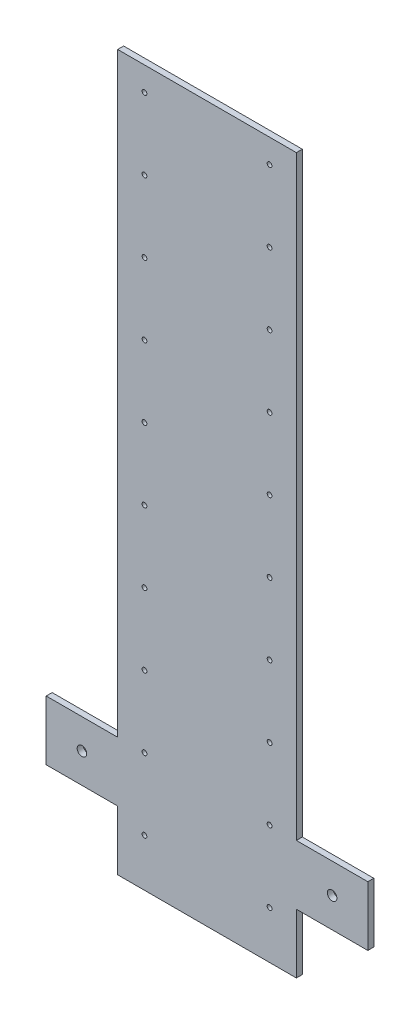
ISO-10303-21;
HEADER;
FILE_DESCRIPTION(('STEP AP214'),'2;1');
FILE_NAME('part.step','',(''),(''),'','','');
FILE_SCHEMA(('AUTOMOTIVE_DESIGN { 1 0 10303 214 1 1 1 1 }'));
ENDSEC;
DATA;
#1=APPLICATION_CONTEXT('core data for automotive mechanical design processes');
#2=APPLICATION_PROTOCOL_DEFINITION('international standard','automotive_design',2000,#1);
#3=PRODUCT_CONTEXT('',#1,'mechanical');
#4=PRODUCT('Part','Part','',(#3));
#5=PRODUCT_RELATED_PRODUCT_CATEGORY('part','',(#4));
#6=PRODUCT_DEFINITION_FORMATION('','',#4);
#7=PRODUCT_DEFINITION_CONTEXT('part definition',#1,'design');
#8=PRODUCT_DEFINITION('design','',#6,#7);
#9=PRODUCT_DEFINITION_SHAPE('','',#8);
#10=(LENGTH_UNIT() NAMED_UNIT(*) SI_UNIT(.MILLI.,.METRE.));
#11=(NAMED_UNIT(*) PLANE_ANGLE_UNIT() SI_UNIT($,.RADIAN.));
#12=(NAMED_UNIT(*) SI_UNIT($,.STERADIAN.) SOLID_ANGLE_UNIT());
#13=UNCERTAINTY_MEASURE_WITH_UNIT(LENGTH_MEASURE(1.E-05),#10,'distance_accuracy_value','');
#14=(GEOMETRIC_REPRESENTATION_CONTEXT(3) GLOBAL_UNCERTAINTY_ASSIGNED_CONTEXT((#13)) GLOBAL_UNIT_ASSIGNED_CONTEXT((#10,
#11,#12)) REPRESENTATION_CONTEXT('',''));
#15=CARTESIAN_POINT('',(0.,0.,0.));
#16=DIRECTION('',(0.,0.,1.));
#17=DIRECTION('',(1.,0.,0.));
#18=AXIS2_PLACEMENT_3D('',#15,#16,#17);
#19=CARTESIAN_POINT('',(0.,0.,5.));
#20=DIRECTION('',(0.,0.,1.));
#21=DIRECTION('',(1.,0.,0.));
#22=AXIS2_PLACEMENT_3D('',#19,#20,#21);
#23=PLANE('',#22);
#24=CARTESIAN_POINT('',(52.5,100.,5.));
#25=DIRECTION('',(0.,0.,1.));
#26=DIRECTION('',(-1.,0.,0.));
#27=AXIS2_PLACEMENT_3D('',#24,#25,#26);
#28=CIRCLE('',#27,2.);
#29=CARTESIAN_POINT('',(50.5,100.,5.));
#30=VERTEX_POINT('',#29);
#31=EDGE_CURVE('E405',#30,#30,#28,.T.);
#32=ORIENTED_EDGE('',*,*,#31,.F.);
#33=EDGE_LOOP('',(#32));
#34=FACE_BOUND('',#33,.T.);
#35=CARTESIAN_POINT('',(52.5,40.,5.));
#36=DIRECTION('',(0.,0.,1.));
#37=DIRECTION('',(-1.,0.,0.));
#38=AXIS2_PLACEMENT_3D('',#35,#36,#37);
#39=CIRCLE('',#38,2.);
#40=CARTESIAN_POINT('',(50.5,40.,5.));
#41=VERTEX_POINT('',#40);
#42=EDGE_CURVE('E475',#41,#41,#39,.T.);
#43=ORIENTED_EDGE('',*,*,#42,.F.);
#44=EDGE_LOOP('',(#43));
#45=FACE_BOUND('',#44,.T.);
#46=CARTESIAN_POINT('',(52.5,-20.,5.));
#47=DIRECTION('',(0.,0.,1.));
#48=DIRECTION('',(-1.,0.,0.));
#49=AXIS2_PLACEMENT_3D('',#46,#47,#48);
#50=CIRCLE('',#49,2.);
#51=CARTESIAN_POINT('',(50.5,-20.,5.));
#52=VERTEX_POINT('',#51);
#53=EDGE_CURVE('E467',#52,#52,#50,.T.);
#54=ORIENTED_EDGE('',*,*,#53,.F.);
#55=EDGE_LOOP('',(#54));
#56=FACE_BOUND('',#55,.T.);
#57=CARTESIAN_POINT('',(52.5,-80.,5.));
#58=DIRECTION('',(0.,0.,1.));
#59=DIRECTION('',(-1.,0.,0.));
#60=AXIS2_PLACEMENT_3D('',#57,#58,#59);
#61=CIRCLE('',#60,2.);
#62=CARTESIAN_POINT('',(50.5,-80.,5.));
#63=VERTEX_POINT('',#62);
#64=EDGE_CURVE('E459',#63,#63,#61,.T.);
#65=ORIENTED_EDGE('',*,*,#64,.F.);
#66=EDGE_LOOP('',(#65));
#67=FACE_BOUND('',#66,.T.);
#68=CARTESIAN_POINT('',(52.5,-140.,5.));
#69=DIRECTION('',(0.,0.,1.));
#70=DIRECTION('',(-1.,0.,0.));
#71=AXIS2_PLACEMENT_3D('',#68,#69,#70);
#72=CIRCLE('',#71,2.);
#73=CARTESIAN_POINT('',(50.5,-140.,5.));
#74=VERTEX_POINT('',#73);
#75=EDGE_CURVE('E451',#74,#74,#72,.T.);
#76=ORIENTED_EDGE('',*,*,#75,.F.);
#77=EDGE_LOOP('',(#76));
#78=FACE_BOUND('',#77,.T.);
#79=CARTESIAN_POINT('',(52.5,-200.,5.));
#80=DIRECTION('',(0.,0.,1.));
#81=DIRECTION('',(-1.,0.,0.));
#82=AXIS2_PLACEMENT_3D('',#79,#80,#81);
#83=CIRCLE('',#82,2.);
#84=CARTESIAN_POINT('',(50.5,-200.,5.));
#85=VERTEX_POINT('',#84);
#86=EDGE_CURVE('E443',#85,#85,#83,.T.);
#87=ORIENTED_EDGE('',*,*,#86,.F.);
#88=EDGE_LOOP('',(#87));
#89=FACE_BOUND('',#88,.T.);
#90=CARTESIAN_POINT('',(-52.5,-260.,5.));
#91=DIRECTION('',(0.,0.,1.));
#92=DIRECTION('',(1.,0.,0.));
#93=AXIS2_PLACEMENT_3D('',#90,#91,#92);
#94=CIRCLE('',#93,2.);
#95=CARTESIAN_POINT('',(-50.5,-260.,5.));
#96=VERTEX_POINT('',#95);
#97=EDGE_CURVE('E435',#96,#96,#94,.T.);
#98=ORIENTED_EDGE('',*,*,#97,.F.);
#99=EDGE_LOOP('',(#98));
#100=FACE_BOUND('',#99,.T.);
#101=CARTESIAN_POINT('',(-52.5,-200.,5.));
#102=DIRECTION('',(0.,0.,1.));
#103=DIRECTION('',(1.,0.,0.));
#104=AXIS2_PLACEMENT_3D('',#101,#102,#103);
#105=CIRCLE('',#104,2.);
#106=CARTESIAN_POINT('',(-50.5,-200.,5.));
#107=VERTEX_POINT('',#106);
#108=EDGE_CURVE('E427',#107,#107,#105,.T.);
#109=ORIENTED_EDGE('',*,*,#108,.F.);
#110=EDGE_LOOP('',(#109));
#111=FACE_BOUND('',#110,.T.);
#112=CARTESIAN_POINT('',(-52.5,-140.,5.));
#113=DIRECTION('',(0.,0.,1.));
#114=DIRECTION('',(1.,0.,0.));
#115=AXIS2_PLACEMENT_3D('',#112,#113,#114);
#116=CIRCLE('',#115,2.);
#117=CARTESIAN_POINT('',(-50.5,-140.,5.));
#118=VERTEX_POINT('',#117);
#119=EDGE_CURVE('E426',#118,#118,#116,.T.);
#120=ORIENTED_EDGE('',*,*,#119,.F.);
#121=EDGE_LOOP('',(#120));
#122=FACE_BOUND('',#121,.T.);
#123=CARTESIAN_POINT('',(-52.5,-80.,5.));
#124=DIRECTION('',(0.,0.,1.));
#125=DIRECTION('',(1.,0.,0.));
#126=AXIS2_PLACEMENT_3D('',#123,#124,#125);
#127=CIRCLE('',#126,2.);
#128=CARTESIAN_POINT('',(-50.5,-80.,5.));
#129=VERTEX_POINT('',#128);
#130=EDGE_CURVE('E539',#129,#129,#127,.T.);
#131=ORIENTED_EDGE('',*,*,#130,.F.);
#132=EDGE_LOOP('',(#131));
#133=FACE_BOUND('',#132,.T.);
#134=CARTESIAN_POINT('',(-52.5,-20.,5.));
#135=DIRECTION('',(0.,0.,1.));
#136=DIRECTION('',(1.,0.,0.));
#137=AXIS2_PLACEMENT_3D('',#134,#135,#136);
#138=CIRCLE('',#137,2.);
#139=CARTESIAN_POINT('',(-50.5,-20.,5.));
#140=VERTEX_POINT('',#139);
#141=EDGE_CURVE('E531',#140,#140,#138,.T.);
#142=ORIENTED_EDGE('',*,*,#141,.F.);
#143=EDGE_LOOP('',(#142));
#144=FACE_BOUND('',#143,.T.);
#145=CARTESIAN_POINT('',(-52.5,40.,5.));
#146=DIRECTION('',(0.,0.,1.));
#147=DIRECTION('',(1.,0.,0.));
#148=AXIS2_PLACEMENT_3D('',#145,#146,#147);
#149=CIRCLE('',#148,2.);
#150=CARTESIAN_POINT('',(-50.5,40.,5.));
#151=VERTEX_POINT('',#150);
#152=EDGE_CURVE('E523',#151,#151,#149,.T.);
#153=ORIENTED_EDGE('',*,*,#152,.F.);
#154=EDGE_LOOP('',(#153));
#155=FACE_BOUND('',#154,.T.);
#156=CARTESIAN_POINT('',(-52.5,100.,5.));
#157=DIRECTION('',(0.,0.,1.));
#158=DIRECTION('',(1.,0.,0.));
#159=AXIS2_PLACEMENT_3D('',#156,#157,#158);
#160=CIRCLE('',#159,2.);
#161=CARTESIAN_POINT('',(-50.5,100.,5.));
#162=VERTEX_POINT('',#161);
#163=EDGE_CURVE('E515',#162,#162,#160,.T.);
#164=ORIENTED_EDGE('',*,*,#163,.F.);
#165=EDGE_LOOP('',(#164));
#166=FACE_BOUND('',#165,.T.);
#167=CARTESIAN_POINT('',(-52.5,160.,5.));
#168=DIRECTION('',(0.,0.,1.));
#169=DIRECTION('',(1.,0.,0.));
#170=AXIS2_PLACEMENT_3D('',#167,#168,#169);
#171=CIRCLE('',#170,2.00000000000001);
#172=CARTESIAN_POINT('',(-50.5,160.,5.));
#173=VERTEX_POINT('',#172);
#174=EDGE_CURVE('E507',#173,#173,#171,.T.);
#175=ORIENTED_EDGE('',*,*,#174,.F.);
#176=EDGE_LOOP('',(#175));
#177=FACE_BOUND('',#176,.T.);
#178=CARTESIAN_POINT('',(-52.5,220.,5.));
#179=DIRECTION('',(0.,0.,1.));
#180=DIRECTION('',(1.,0.,0.));
#181=AXIS2_PLACEMENT_3D('',#178,#179,#180);
#182=CIRCLE('',#181,2.);
#183=CARTESIAN_POINT('',(-50.5,220.,5.));
#184=VERTEX_POINT('',#183);
#185=EDGE_CURVE('E499',#184,#184,#182,.T.);
#186=ORIENTED_EDGE('',*,*,#185,.F.);
#187=EDGE_LOOP('',(#186));
#188=FACE_BOUND('',#187,.T.);
#189=CARTESIAN_POINT('',(-52.5,280.,5.));
#190=DIRECTION('',(0.,0.,1.));
#191=DIRECTION('',(1.,0.,0.));
#192=AXIS2_PLACEMENT_3D('',#189,#190,#191);
#193=CIRCLE('',#192,2.00000000000002);
#194=CARTESIAN_POINT('',(-50.5,280.,5.));
#195=VERTEX_POINT('',#194);
#196=EDGE_CURVE('E491',#195,#195,#193,.T.);
#197=ORIENTED_EDGE('',*,*,#196,.F.);
#198=EDGE_LOOP('',(#197));
#199=FACE_BOUND('',#198,.T.);
#200=CARTESIAN_POINT('',(52.5,160.,5.));
#201=DIRECTION('',(0.,0.,1.));
#202=DIRECTION('',(-1.,0.,0.));
#203=AXIS2_PLACEMENT_3D('',#200,#201,#202);
#204=CIRCLE('',#203,2.00000000000001);
#205=CARTESIAN_POINT('',(50.5,160.,5.));
#206=VERTEX_POINT('',#205);
#207=EDGE_CURVE('E398',#206,#206,#204,.T.);
#208=ORIENTED_EDGE('',*,*,#207,.F.);
#209=EDGE_LOOP('',(#208));
#210=FACE_BOUND('',#209,.T.);
#211=CARTESIAN_POINT('',(52.5,220.,5.));
#212=DIRECTION('',(0.,0.,1.));
#213=DIRECTION('',(-1.,0.,0.));
#214=AXIS2_PLACEMENT_3D('',#211,#212,#213);
#215=CIRCLE('',#214,2.);
#216=CARTESIAN_POINT('',(50.5,220.,5.));
#217=VERTEX_POINT('',#216);
#218=EDGE_CURVE('E408',#217,#217,#215,.T.);
#219=ORIENTED_EDGE('',*,*,#218,.F.);
#220=EDGE_LOOP('',(#219));
#221=FACE_BOUND('',#220,.T.);
#222=CARTESIAN_POINT('',(52.5,280.,5.));
#223=DIRECTION('',(0.,0.,1.));
#224=DIRECTION('',(-1.,0.,0.));
#225=AXIS2_PLACEMENT_3D('',#222,#223,#224);
#226=CIRCLE('',#225,2.00000000000002);
#227=CARTESIAN_POINT('',(50.5,280.,5.));
#228=VERTEX_POINT('',#227);
#229=EDGE_CURVE('E418',#228,#228,#226,.T.);
#230=ORIENTED_EDGE('',*,*,#229,.F.);
#231=EDGE_LOOP('',(#230));
#232=FACE_BOUND('',#231,.T.);
#233=CARTESIAN_POINT('',(52.5,-260.,5.));
#234=DIRECTION('',(0.,0.,1.));
#235=DIRECTION('',(-1.,0.,0.));
#236=AXIS2_PLACEMENT_3D('',#233,#234,#235);
#237=CIRCLE('',#236,2.);
#238=CARTESIAN_POINT('',(50.5,-260.,5.));
#239=VERTEX_POINT('',#238);
#240=EDGE_CURVE('E490',#239,#239,#237,.T.);
#241=ORIENTED_EDGE('',*,*,#240,.F.);
#242=EDGE_LOOP('',(#241));
#243=FACE_BOUND('',#242,.T.);
#244=CARTESIAN_POINT('',(-105.,-225.,5.));
#245=DIRECTION('',(0.,0.,1.));
#246=DIRECTION('',(1.,0.,0.));
#247=AXIS2_PLACEMENT_3D('',#244,#245,#246);
#248=CIRCLE('',#247,3.99999999999999);
#249=CARTESIAN_POINT('',(-101.,-225.,5.));
#250=VERTEX_POINT('',#249);
#251=EDGE_CURVE('E170',#250,#250,#248,.T.);
#252=ORIENTED_EDGE('',*,*,#251,.F.);
#253=EDGE_LOOP('',(#252));
#254=FACE_BOUND('',#253,.T.);
#255=DIRECTION('',(1.,0.,0.));
#256=VECTOR('',#255,1.);
#257=CARTESIAN_POINT('',(135.,-250.,5.));
#258=LINE('',#257,#256);
#259=CARTESIAN_POINT('',(75.,-250.,5.));
#260=VERTEX_POINT('',#259);
#261=CARTESIAN_POINT('',(135.,-250.,5.));
#262=VERTEX_POINT('',#261);
#263=EDGE_CURVE('E200',#260,#262,#258,.T.);
#264=ORIENTED_EDGE('',*,*,#263,.T.);
#265=DIRECTION('',(0.,1.,0.));
#266=VECTOR('',#265,1.);
#267=CARTESIAN_POINT('',(135.,-200.,5.));
#268=LINE('',#267,#266);
#269=CARTESIAN_POINT('',(135.,-200.,5.));
#270=VERTEX_POINT('',#269);
#271=EDGE_CURVE('E112',#262,#270,#268,.T.);
#272=ORIENTED_EDGE('',*,*,#271,.T.);
#273=DIRECTION('',(-1.,0.,0.));
#274=VECTOR('',#273,1.);
#275=CARTESIAN_POINT('',(75.,-200.,5.));
#276=LINE('',#275,#274);
#277=CARTESIAN_POINT('',(75.,-200.,5.));
#278=VERTEX_POINT('',#277);
#279=EDGE_CURVE('E237',#270,#278,#276,.T.);
#280=ORIENTED_EDGE('',*,*,#279,.T.);
#281=DIRECTION('',(0.,1.,0.));
#282=VECTOR('',#281,1.);
#283=CARTESIAN_POINT('',(75.,300.,5.));
#284=LINE('',#283,#282);
#285=CARTESIAN_POINT('',(75.,300.,5.));
#286=VERTEX_POINT('',#285);
#287=EDGE_CURVE('E257',#278,#286,#284,.T.);
#288=ORIENTED_EDGE('',*,*,#287,.T.);
#289=DIRECTION('',(-1.,0.,0.));
#290=VECTOR('',#289,1.);
#291=CARTESIAN_POINT('',(75.,300.,5.));
#292=LINE('',#291,#290);
#293=CARTESIAN_POINT('',(-75.,300.,5.));
#294=VERTEX_POINT('',#293);
#295=EDGE_CURVE('E253',#286,#294,#292,.T.);
#296=ORIENTED_EDGE('',*,*,#295,.T.);
#297=DIRECTION('',(0.,-1.,0.));
#298=VECTOR('',#297,1.);
#299=CARTESIAN_POINT('',(-75.,300.,5.));
#300=LINE('',#299,#298);
#301=CARTESIAN_POINT('',(-75.,-200.,5.));
#302=VERTEX_POINT('',#301);
#303=EDGE_CURVE('E256',#294,#302,#300,.T.);
#304=ORIENTED_EDGE('',*,*,#303,.T.);
#305=DIRECTION('',(-1.,0.,0.));
#306=VECTOR('',#305,1.);
#307=CARTESIAN_POINT('',(-75.,-200.,5.));
#308=LINE('',#307,#306);
#309=CARTESIAN_POINT('',(-135.,-200.,5.));
#310=VERTEX_POINT('',#309);
#311=EDGE_CURVE('E261',#302,#310,#308,.T.);
#312=ORIENTED_EDGE('',*,*,#311,.T.);
#313=DIRECTION('',(0.,-1.,0.));
#314=VECTOR('',#313,1.);
#315=CARTESIAN_POINT('',(-135.,-200.,5.));
#316=LINE('',#315,#314);
#317=CARTESIAN_POINT('',(-135.,-250.,5.));
#318=VERTEX_POINT('',#317);
#319=EDGE_CURVE('E268',#310,#318,#316,.T.);
#320=ORIENTED_EDGE('',*,*,#319,.T.);
#321=DIRECTION('',(1.,0.,0.));
#322=VECTOR('',#321,1.);
#323=CARTESIAN_POINT('',(-135.,-250.,5.));
#324=LINE('',#323,#322);
#325=CARTESIAN_POINT('',(-75.,-250.,5.));
#326=VERTEX_POINT('',#325);
#327=EDGE_CURVE('E143',#318,#326,#324,.T.);
#328=ORIENTED_EDGE('',*,*,#327,.T.);
#329=DIRECTION('',(0.,-1.,0.));
#330=VECTOR('',#329,1.);
#331=CARTESIAN_POINT('',(-75.,-250.,5.));
#332=LINE('',#331,#330);
#333=CARTESIAN_POINT('',(-75.,-300.,5.));
#334=VERTEX_POINT('',#333);
#335=EDGE_CURVE('E137',#326,#334,#332,.T.);
#336=ORIENTED_EDGE('',*,*,#335,.T.);
#337=DIRECTION('',(1.,0.,0.));
#338=VECTOR('',#337,1.);
#339=CARTESIAN_POINT('',(-75.,-300.,5.));
#340=LINE('',#339,#338);
#341=CARTESIAN_POINT('',(75.,-300.,5.));
#342=VERTEX_POINT('',#341);
#343=EDGE_CURVE('E141',#334,#342,#340,.T.);
#344=ORIENTED_EDGE('',*,*,#343,.T.);
#345=DIRECTION('',(0.,1.,0.));
#346=VECTOR('',#345,1.);
#347=CARTESIAN_POINT('',(75.,-250.,5.));
#348=LINE('',#347,#346);
#349=EDGE_CURVE('E57',#342,#260,#348,.T.);
#350=ORIENTED_EDGE('',*,*,#349,.T.);
#351=EDGE_LOOP('',(#264,#272,#280,#288,#296,#304,#312,#320,#328,#336,#344,#350));
#352=FACE_BOUND('',#351,.T.);
#353=CARTESIAN_POINT('',(105.,-225.,5.));
#354=DIRECTION('',(0.,0.,1.));
#355=DIRECTION('',(1.,0.,0.));
#356=AXIS2_PLACEMENT_3D('',#353,#354,#355);
#357=CIRCLE('',#356,3.99999999999999);
#358=CARTESIAN_POINT('',(109.,-225.,5.));
#359=VERTEX_POINT('',#358);
#360=EDGE_CURVE('E558',#359,#359,#357,.T.);
#361=ORIENTED_EDGE('',*,*,#360,.F.);
#362=EDGE_LOOP('',(#361));
#363=FACE_BOUND('',#362,.T.);
#364=ADVANCED_FACE('F39',(#34,#45,#56,#67,#78,#89,#100,#111,#122,#133,#144,#155,#166,#177,#188,
#199,#210,#221,#232,#243,#254,#352,#363),#23,.T.);
#365=CARTESIAN_POINT('',(0.,0.,0.));
#366=DIRECTION('',(0.,0.,1.));
#367=DIRECTION('',(1.,0.,0.));
#368=AXIS2_PLACEMENT_3D('',#365,#366,#367);
#369=PLANE('',#368);
#370=CARTESIAN_POINT('',(52.5,100.,0.));
#371=DIRECTION('',(0.,0.,1.));
#372=DIRECTION('',(-1.,0.,0.));
#373=AXIS2_PLACEMENT_3D('',#370,#371,#372);
#374=CIRCLE('',#373,2.);
#375=CARTESIAN_POINT('',(50.5,100.,0.));
#376=VERTEX_POINT('',#375);
#377=EDGE_CURVE('E479',#376,#376,#374,.T.);
#378=ORIENTED_EDGE('',*,*,#377,.T.);
#379=EDGE_LOOP('',(#378));
#380=FACE_BOUND('',#379,.T.);
#381=CARTESIAN_POINT('',(52.5,40.,0.));
#382=DIRECTION('',(0.,0.,1.));
#383=DIRECTION('',(-1.,0.,0.));
#384=AXIS2_PLACEMENT_3D('',#381,#382,#383);
#385=CIRCLE('',#384,2.);
#386=CARTESIAN_POINT('',(50.5,40.,0.));
#387=VERTEX_POINT('',#386);
#388=EDGE_CURVE('E471',#387,#387,#385,.T.);
#389=ORIENTED_EDGE('',*,*,#388,.T.);
#390=EDGE_LOOP('',(#389));
#391=FACE_BOUND('',#390,.T.);
#392=CARTESIAN_POINT('',(52.5,-20.,0.));
#393=DIRECTION('',(0.,0.,1.));
#394=DIRECTION('',(-1.,0.,0.));
#395=AXIS2_PLACEMENT_3D('',#392,#393,#394);
#396=CIRCLE('',#395,2.);
#397=CARTESIAN_POINT('',(50.5,-20.,0.));
#398=VERTEX_POINT('',#397);
#399=EDGE_CURVE('E463',#398,#398,#396,.T.);
#400=ORIENTED_EDGE('',*,*,#399,.T.);
#401=EDGE_LOOP('',(#400));
#402=FACE_BOUND('',#401,.T.);
#403=CARTESIAN_POINT('',(52.5,-80.,0.));
#404=DIRECTION('',(0.,0.,1.));
#405=DIRECTION('',(-1.,0.,0.));
#406=AXIS2_PLACEMENT_3D('',#403,#404,#405);
#407=CIRCLE('',#406,2.);
#408=CARTESIAN_POINT('',(50.5,-80.,0.));
#409=VERTEX_POINT('',#408);
#410=EDGE_CURVE('E455',#409,#409,#407,.T.);
#411=ORIENTED_EDGE('',*,*,#410,.T.);
#412=EDGE_LOOP('',(#411));
#413=FACE_BOUND('',#412,.T.);
#414=CARTESIAN_POINT('',(52.5,-140.,0.));
#415=DIRECTION('',(0.,0.,1.));
#416=DIRECTION('',(-1.,0.,0.));
#417=AXIS2_PLACEMENT_3D('',#414,#415,#416);
#418=CIRCLE('',#417,2.);
#419=CARTESIAN_POINT('',(50.5,-140.,0.));
#420=VERTEX_POINT('',#419);
#421=EDGE_CURVE('E447',#420,#420,#418,.T.);
#422=ORIENTED_EDGE('',*,*,#421,.T.);
#423=EDGE_LOOP('',(#422));
#424=FACE_BOUND('',#423,.T.);
#425=CARTESIAN_POINT('',(52.5,-200.,0.));
#426=DIRECTION('',(0.,0.,1.));
#427=DIRECTION('',(-1.,0.,0.));
#428=AXIS2_PLACEMENT_3D('',#425,#426,#427);
#429=CIRCLE('',#428,2.);
#430=CARTESIAN_POINT('',(50.5,-200.,0.));
#431=VERTEX_POINT('',#430);
#432=EDGE_CURVE('E439',#431,#431,#429,.T.);
#433=ORIENTED_EDGE('',*,*,#432,.T.);
#434=EDGE_LOOP('',(#433));
#435=FACE_BOUND('',#434,.T.);
#436=CARTESIAN_POINT('',(-52.5,-260.,0.));
#437=DIRECTION('',(0.,0.,1.));
#438=DIRECTION('',(1.,0.,0.));
#439=AXIS2_PLACEMENT_3D('',#436,#437,#438);
#440=CIRCLE('',#439,2.);
#441=CARTESIAN_POINT('',(-50.5,-260.,0.));
#442=VERTEX_POINT('',#441);
#443=EDGE_CURVE('E431',#442,#442,#440,.T.);
#444=ORIENTED_EDGE('',*,*,#443,.T.);
#445=EDGE_LOOP('',(#444));
#446=FACE_BOUND('',#445,.T.);
#447=CARTESIAN_POINT('',(-52.5,-200.,0.));
#448=DIRECTION('',(0.,0.,1.));
#449=DIRECTION('',(1.,0.,0.));
#450=AXIS2_PLACEMENT_3D('',#447,#448,#449);
#451=CIRCLE('',#450,2.);
#452=CARTESIAN_POINT('',(-50.5,-200.,0.));
#453=VERTEX_POINT('',#452);
#454=EDGE_CURVE('E422',#453,#453,#451,.T.);
#455=ORIENTED_EDGE('',*,*,#454,.T.);
#456=EDGE_LOOP('',(#455));
#457=FACE_BOUND('',#456,.T.);
#458=CARTESIAN_POINT('',(-52.5,-140.,0.));
#459=DIRECTION('',(0.,0.,1.));
#460=DIRECTION('',(1.,0.,0.));
#461=AXIS2_PLACEMENT_3D('',#458,#459,#460);
#462=CIRCLE('',#461,2.);
#463=CARTESIAN_POINT('',(-50.5,-140.,0.));
#464=VERTEX_POINT('',#463);
#465=EDGE_CURVE('E543',#464,#464,#462,.T.);
#466=ORIENTED_EDGE('',*,*,#465,.T.);
#467=EDGE_LOOP('',(#466));
#468=FACE_BOUND('',#467,.T.);
#469=CARTESIAN_POINT('',(-52.5,-80.,0.));
#470=DIRECTION('',(0.,0.,1.));
#471=DIRECTION('',(1.,0.,0.));
#472=AXIS2_PLACEMENT_3D('',#469,#470,#471);
#473=CIRCLE('',#472,2.);
#474=CARTESIAN_POINT('',(-50.5,-80.,0.));
#475=VERTEX_POINT('',#474);
#476=EDGE_CURVE('E535',#475,#475,#473,.T.);
#477=ORIENTED_EDGE('',*,*,#476,.T.);
#478=EDGE_LOOP('',(#477));
#479=FACE_BOUND('',#478,.T.);
#480=CARTESIAN_POINT('',(-52.5,-20.,0.));
#481=DIRECTION('',(0.,0.,1.));
#482=DIRECTION('',(1.,0.,0.));
#483=AXIS2_PLACEMENT_3D('',#480,#481,#482);
#484=CIRCLE('',#483,2.);
#485=CARTESIAN_POINT('',(-50.5,-20.,0.));
#486=VERTEX_POINT('',#485);
#487=EDGE_CURVE('E527',#486,#486,#484,.T.);
#488=ORIENTED_EDGE('',*,*,#487,.T.);
#489=EDGE_LOOP('',(#488));
#490=FACE_BOUND('',#489,.T.);
#491=CARTESIAN_POINT('',(-52.5,40.,0.));
#492=DIRECTION('',(0.,0.,1.));
#493=DIRECTION('',(1.,0.,0.));
#494=AXIS2_PLACEMENT_3D('',#491,#492,#493);
#495=CIRCLE('',#494,2.);
#496=CARTESIAN_POINT('',(-50.5,40.,0.));
#497=VERTEX_POINT('',#496);
#498=EDGE_CURVE('E519',#497,#497,#495,.T.);
#499=ORIENTED_EDGE('',*,*,#498,.T.);
#500=EDGE_LOOP('',(#499));
#501=FACE_BOUND('',#500,.T.);
#502=CARTESIAN_POINT('',(-52.5,100.,0.));
#503=DIRECTION('',(0.,0.,1.));
#504=DIRECTION('',(1.,0.,0.));
#505=AXIS2_PLACEMENT_3D('',#502,#503,#504);
#506=CIRCLE('',#505,2.);
#507=CARTESIAN_POINT('',(-50.5,100.,0.));
#508=VERTEX_POINT('',#507);
#509=EDGE_CURVE('E511',#508,#508,#506,.T.);
#510=ORIENTED_EDGE('',*,*,#509,.T.);
#511=EDGE_LOOP('',(#510));
#512=FACE_BOUND('',#511,.T.);
#513=CARTESIAN_POINT('',(-52.5,160.,0.));
#514=DIRECTION('',(0.,0.,1.));
#515=DIRECTION('',(1.,0.,0.));
#516=AXIS2_PLACEMENT_3D('',#513,#514,#515);
#517=CIRCLE('',#516,2.00000000000001);
#518=CARTESIAN_POINT('',(-50.5,160.,0.));
#519=VERTEX_POINT('',#518);
#520=EDGE_CURVE('E503',#519,#519,#517,.T.);
#521=ORIENTED_EDGE('',*,*,#520,.T.);
#522=EDGE_LOOP('',(#521));
#523=FACE_BOUND('',#522,.T.);
#524=CARTESIAN_POINT('',(-52.5,220.,0.));
#525=DIRECTION('',(0.,0.,1.));
#526=DIRECTION('',(1.,0.,0.));
#527=AXIS2_PLACEMENT_3D('',#524,#525,#526);
#528=CIRCLE('',#527,2.);
#529=CARTESIAN_POINT('',(-50.5,220.,0.));
#530=VERTEX_POINT('',#529);
#531=EDGE_CURVE('E495',#530,#530,#528,.T.);
#532=ORIENTED_EDGE('',*,*,#531,.T.);
#533=EDGE_LOOP('',(#532));
#534=FACE_BOUND('',#533,.T.);
#535=CARTESIAN_POINT('',(-52.5,280.,0.));
#536=DIRECTION('',(0.,0.,1.));
#537=DIRECTION('',(1.,0.,0.));
#538=AXIS2_PLACEMENT_3D('',#535,#536,#537);
#539=CIRCLE('',#538,2.00000000000002);
#540=CARTESIAN_POINT('',(-50.5,280.,0.));
#541=VERTEX_POINT('',#540);
#542=EDGE_CURVE('E486',#541,#541,#539,.T.);
#543=ORIENTED_EDGE('',*,*,#542,.T.);
#544=EDGE_LOOP('',(#543));
#545=FACE_BOUND('',#544,.T.);
#546=CARTESIAN_POINT('',(52.5,160.,0.));
#547=DIRECTION('',(0.,0.,1.));
#548=DIRECTION('',(-1.,0.,0.));
#549=AXIS2_PLACEMENT_3D('',#546,#547,#548);
#550=CIRCLE('',#549,2.00000000000001);
#551=CARTESIAN_POINT('',(50.5,160.,0.));
#552=VERTEX_POINT('',#551);
#553=EDGE_CURVE('E395',#552,#552,#550,.T.);
#554=ORIENTED_EDGE('',*,*,#553,.T.);
#555=EDGE_LOOP('',(#554));
#556=FACE_BOUND('',#555,.T.);
#557=CARTESIAN_POINT('',(52.5,220.,0.));
#558=DIRECTION('',(0.,0.,1.));
#559=DIRECTION('',(-1.,0.,0.));
#560=AXIS2_PLACEMENT_3D('',#557,#558,#559);
#561=CIRCLE('',#560,2.);
#562=CARTESIAN_POINT('',(50.5,220.,0.));
#563=VERTEX_POINT('',#562);
#564=EDGE_CURVE('E401',#563,#563,#561,.T.);
#565=ORIENTED_EDGE('',*,*,#564,.T.);
#566=EDGE_LOOP('',(#565));
#567=FACE_BOUND('',#566,.T.);
#568=CARTESIAN_POINT('',(52.5,280.,0.));
#569=DIRECTION('',(0.,0.,1.));
#570=DIRECTION('',(-1.,0.,0.));
#571=AXIS2_PLACEMENT_3D('',#568,#569,#570);
#572=CIRCLE('',#571,2.00000000000002);
#573=CARTESIAN_POINT('',(50.5,280.,0.));
#574=VERTEX_POINT('',#573);
#575=EDGE_CURVE('E414',#574,#574,#572,.T.);
#576=ORIENTED_EDGE('',*,*,#575,.T.);
#577=EDGE_LOOP('',(#576));
#578=FACE_BOUND('',#577,.T.);
#579=CARTESIAN_POINT('',(52.5,-260.,0.));
#580=DIRECTION('',(0.,0.,1.));
#581=DIRECTION('',(-1.,0.,0.));
#582=AXIS2_PLACEMENT_3D('',#579,#580,#581);
#583=CIRCLE('',#582,2.);
#584=CARTESIAN_POINT('',(50.5,-260.,0.));
#585=VERTEX_POINT('',#584);
#586=EDGE_CURVE('E550',#585,#585,#583,.T.);
#587=ORIENTED_EDGE('',*,*,#586,.T.);
#588=EDGE_LOOP('',(#587));
#589=FACE_BOUND('',#588,.T.);
#590=DIRECTION('',(1.,0.,0.));
#591=VECTOR('',#590,1.);
#592=CARTESIAN_POINT('',(135.,-250.,0.));
#593=LINE('',#592,#591);
#594=CARTESIAN_POINT('',(75.,-250.,0.));
#595=VERTEX_POINT('',#594);
#596=CARTESIAN_POINT('',(135.,-250.,0.));
#597=VERTEX_POINT('',#596);
#598=EDGE_CURVE('E165',#595,#597,#593,.T.);
#599=ORIENTED_EDGE('',*,*,#598,.F.);
#600=DIRECTION('',(0.,1.,0.));
#601=VECTOR('',#600,1.);
#602=CARTESIAN_POINT('',(75.,-250.,0.));
#603=LINE('',#602,#601);
#604=CARTESIAN_POINT('',(75.,-300.,0.));
#605=VERTEX_POINT('',#604);
#606=EDGE_CURVE('E104',#605,#595,#603,.T.);
#607=ORIENTED_EDGE('',*,*,#606,.F.);
#608=DIRECTION('',(1.,0.,0.));
#609=VECTOR('',#608,1.);
#610=CARTESIAN_POINT('',(-75.,-300.,0.));
#611=LINE('',#610,#609);
#612=CARTESIAN_POINT('',(-75.,-300.,0.));
#613=VERTEX_POINT('',#612);
#614=EDGE_CURVE('E98',#613,#605,#611,.T.);
#615=ORIENTED_EDGE('',*,*,#614,.F.);
#616=DIRECTION('',(0.,-1.,0.));
#617=VECTOR('',#616,1.);
#618=CARTESIAN_POINT('',(-75.,-250.,0.));
#619=LINE('',#618,#617);
#620=CARTESIAN_POINT('',(-75.,-250.,0.));
#621=VERTEX_POINT('',#620);
#622=EDGE_CURVE('E152',#621,#613,#619,.T.);
#623=ORIENTED_EDGE('',*,*,#622,.F.);
#624=DIRECTION('',(1.,0.,0.));
#625=VECTOR('',#624,1.);
#626=CARTESIAN_POINT('',(-135.,-250.,0.));
#627=LINE('',#626,#625);
#628=CARTESIAN_POINT('',(-135.,-250.,0.));
#629=VERTEX_POINT('',#628);
#630=EDGE_CURVE('E191',#629,#621,#627,.T.);
#631=ORIENTED_EDGE('',*,*,#630,.F.);
#632=DIRECTION('',(0.,-1.,0.));
#633=VECTOR('',#632,1.);
#634=CARTESIAN_POINT('',(-135.,-200.,0.));
#635=LINE('',#634,#633);
#636=CARTESIAN_POINT('',(-135.,-200.,0.));
#637=VERTEX_POINT('',#636);
#638=EDGE_CURVE('E188',#637,#629,#635,.T.);
#639=ORIENTED_EDGE('',*,*,#638,.F.);
#640=DIRECTION('',(-1.,0.,0.));
#641=VECTOR('',#640,1.);
#642=CARTESIAN_POINT('',(-75.,-200.,0.));
#643=LINE('',#642,#641);
#644=CARTESIAN_POINT('',(-75.,-200.,0.));
#645=VERTEX_POINT('',#644);
#646=EDGE_CURVE('E185',#645,#637,#643,.T.);
#647=ORIENTED_EDGE('',*,*,#646,.F.);
#648=DIRECTION('',(0.,-1.,0.));
#649=VECTOR('',#648,1.);
#650=CARTESIAN_POINT('',(-75.,300.,0.));
#651=LINE('',#650,#649);
#652=CARTESIAN_POINT('',(-75.,300.,0.));
#653=VERTEX_POINT('',#652);
#654=EDGE_CURVE('E182',#653,#645,#651,.T.);
#655=ORIENTED_EDGE('',*,*,#654,.F.);
#656=DIRECTION('',(-1.,0.,0.));
#657=VECTOR('',#656,1.);
#658=CARTESIAN_POINT('',(75.,300.,0.));
#659=LINE('',#658,#657);
#660=CARTESIAN_POINT('',(75.,300.,0.));
#661=VERTEX_POINT('',#660);
#662=EDGE_CURVE('E179',#661,#653,#659,.T.);
#663=ORIENTED_EDGE('',*,*,#662,.F.);
#664=DIRECTION('',(0.,1.,0.));
#665=VECTOR('',#664,1.);
#666=CARTESIAN_POINT('',(75.,300.,0.));
#667=LINE('',#666,#665);
#668=CARTESIAN_POINT('',(75.,-200.,0.));
#669=VERTEX_POINT('',#668);
#670=EDGE_CURVE('E176',#669,#661,#667,.T.);
#671=ORIENTED_EDGE('',*,*,#670,.F.);
#672=DIRECTION('',(-1.,0.,0.));
#673=VECTOR('',#672,1.);
#674=CARTESIAN_POINT('',(75.,-200.,0.));
#675=LINE('',#674,#673);
#676=CARTESIAN_POINT('',(135.,-200.,0.));
#677=VERTEX_POINT('',#676);
#678=EDGE_CURVE('E173',#677,#669,#675,.T.);
#679=ORIENTED_EDGE('',*,*,#678,.F.);
#680=DIRECTION('',(0.,1.,0.));
#681=VECTOR('',#680,1.);
#682=CARTESIAN_POINT('',(135.,-200.,0.));
#683=LINE('',#682,#681);
#684=EDGE_CURVE('E169',#597,#677,#683,.T.);
#685=ORIENTED_EDGE('',*,*,#684,.F.);
#686=EDGE_LOOP('',(#599,#607,#615,#623,#631,#639,#647,#655,#663,#671,#679,#685));
#687=FACE_BOUND('',#686,.T.);
#688=CARTESIAN_POINT('',(-105.,-225.,0.));
#689=DIRECTION('',(0.,0.,1.));
#690=DIRECTION('',(1.,0.,0.));
#691=AXIS2_PLACEMENT_3D('',#688,#689,#690);
#692=CIRCLE('',#691,3.99999999999999);
#693=CARTESIAN_POINT('',(-101.,-225.,0.));
#694=VERTEX_POINT('',#693);
#695=EDGE_CURVE('E562',#694,#694,#692,.T.);
#696=ORIENTED_EDGE('',*,*,#695,.T.);
#697=EDGE_LOOP('',(#696));
#698=FACE_BOUND('',#697,.T.);
#699=CARTESIAN_POINT('',(105.,-225.,0.));
#700=DIRECTION('',(0.,0.,1.));
#701=DIRECTION('',(1.,0.,0.));
#702=AXIS2_PLACEMENT_3D('',#699,#700,#701);
#703=CIRCLE('',#702,3.99999999999999);
#704=CARTESIAN_POINT('',(109.,-225.,0.));
#705=VERTEX_POINT('',#704);
#706=EDGE_CURVE('E554',#705,#705,#703,.T.);
#707=ORIENTED_EDGE('',*,*,#706,.T.);
#708=EDGE_LOOP('',(#707));
#709=FACE_BOUND('',#708,.T.);
#710=ADVANCED_FACE('F241',(#380,#391,#402,#413,#424,#435,#446,#457,#468,#479,#490,#501,#512,
#523,#534,#545,#556,#567,#578,#589,#687,#698,#709),#369,.F.);
#711=CARTESIAN_POINT('',(135.,-250.,5.));
#712=DIRECTION('',(0.,1.,0.));
#713=DIRECTION('',(0.,0.,1.));
#714=AXIS2_PLACEMENT_3D('',#711,#712,#713);
#715=PLANE('',#714);
#716=ORIENTED_EDGE('',*,*,#598,.T.);
#717=DIRECTION('',(0.,0.,-1.));
#718=VECTOR('',#717,1.);
#719=CARTESIAN_POINT('',(135.,-250.,5.));
#720=LINE('',#719,#718);
#721=EDGE_CURVE('E11',#262,#597,#720,.T.);
#722=ORIENTED_EDGE('',*,*,#721,.F.);
#723=ORIENTED_EDGE('',*,*,#263,.F.);
#724=DIRECTION('',(0.,0.,-1.));
#725=VECTOR('',#724,1.);
#726=CARTESIAN_POINT('',(75.,-250.,5.));
#727=LINE('',#726,#725);
#728=EDGE_CURVE('E161',#260,#595,#727,.T.);
#729=ORIENTED_EDGE('',*,*,#728,.T.);
#730=EDGE_LOOP('',(#716,#722,#723,#729));
#731=FACE_BOUND('',#730,.T.);
#732=ADVANCED_FACE('F41',(#731),#715,.F.);
#733=CARTESIAN_POINT('',(135.,-200.,5.));
#734=DIRECTION('',(-1.,0.,0.));
#735=DIRECTION('',(0.,0.,1.));
#736=AXIS2_PLACEMENT_3D('',#733,#734,#735);
#737=PLANE('',#736);
#738=ORIENTED_EDGE('',*,*,#684,.T.);
#739=DIRECTION('',(0.,0.,-1.));
#740=VECTOR('',#739,1.);
#741=CARTESIAN_POINT('',(135.,-200.,5.));
#742=LINE('',#741,#740);
#743=EDGE_CURVE('E49',#270,#677,#742,.T.);
#744=ORIENTED_EDGE('',*,*,#743,.F.);
#745=ORIENTED_EDGE('',*,*,#271,.F.);
#746=ORIENTED_EDGE('',*,*,#721,.T.);
#747=EDGE_LOOP('',(#738,#744,#745,#746));
#748=FACE_BOUND('',#747,.T.);
#749=ADVANCED_FACE('F869',(#748),#737,.F.);
#750=CARTESIAN_POINT('',(75.,-200.,5.));
#751=DIRECTION('',(0.,-1.,0.));
#752=DIRECTION('',(0.,0.,-1.));
#753=AXIS2_PLACEMENT_3D('',#750,#751,#752);
#754=PLANE('',#753);
#755=ORIENTED_EDGE('',*,*,#678,.T.);
#756=DIRECTION('',(0.,0.,-1.));
#757=VECTOR('',#756,1.);
#758=CARTESIAN_POINT('',(75.,-200.,5.));
#759=LINE('',#758,#757);
#760=EDGE_CURVE('E227',#278,#669,#759,.T.);
#761=ORIENTED_EDGE('',*,*,#760,.F.);
#762=ORIENTED_EDGE('',*,*,#279,.F.);
#763=ORIENTED_EDGE('',*,*,#743,.T.);
#764=EDGE_LOOP('',(#755,#761,#762,#763));
#765=FACE_BOUND('',#764,.T.);
#766=ADVANCED_FACE('F235',(#765),#754,.F.);
#767=CARTESIAN_POINT('',(75.,300.,5.));
#768=DIRECTION('',(-1.,0.,0.));
#769=DIRECTION('',(0.,0.,1.));
#770=AXIS2_PLACEMENT_3D('',#767,#768,#769);
#771=PLANE('',#770);
#772=ORIENTED_EDGE('',*,*,#670,.T.);
#773=DIRECTION('',(0.,0.,-1.));
#774=VECTOR('',#773,1.);
#775=CARTESIAN_POINT('',(75.,300.,5.));
#776=LINE('',#775,#774);
#777=EDGE_CURVE('E223',#286,#661,#776,.T.);
#778=ORIENTED_EDGE('',*,*,#777,.F.);
#779=ORIENTED_EDGE('',*,*,#287,.F.);
#780=ORIENTED_EDGE('',*,*,#760,.T.);
#781=EDGE_LOOP('',(#772,#778,#779,#780));
#782=FACE_BOUND('',#781,.T.);
#783=ADVANCED_FACE('F247',(#782),#771,.F.);
#784=CARTESIAN_POINT('',(75.,300.,5.));
#785=DIRECTION('',(0.,-1.,0.));
#786=DIRECTION('',(0.,0.,-1.));
#787=AXIS2_PLACEMENT_3D('',#784,#785,#786);
#788=PLANE('',#787);
#789=ORIENTED_EDGE('',*,*,#662,.T.);
#790=DIRECTION('',(0.,0.,-1.));
#791=VECTOR('',#790,1.);
#792=CARTESIAN_POINT('',(-75.,300.,5.));
#793=LINE('',#792,#791);
#794=EDGE_CURVE('E219',#294,#653,#793,.T.);
#795=ORIENTED_EDGE('',*,*,#794,.F.);
#796=ORIENTED_EDGE('',*,*,#295,.F.);
#797=ORIENTED_EDGE('',*,*,#777,.T.);
#798=EDGE_LOOP('',(#789,#795,#796,#797));
#799=FACE_BOUND('',#798,.T.);
#800=ADVANCED_FACE('F251',(#799),#788,.F.);
#801=CARTESIAN_POINT('',(-75.,300.,5.));
#802=DIRECTION('',(1.,0.,0.));
#803=DIRECTION('',(0.,0.,-1.));
#804=AXIS2_PLACEMENT_3D('',#801,#802,#803);
#805=PLANE('',#804);
#806=ORIENTED_EDGE('',*,*,#654,.T.);
#807=DIRECTION('',(0.,0.,-1.));
#808=VECTOR('',#807,1.);
#809=CARTESIAN_POINT('',(-75.,-200.,5.));
#810=LINE('',#809,#808);
#811=EDGE_CURVE('E215',#302,#645,#810,.T.);
#812=ORIENTED_EDGE('',*,*,#811,.F.);
#813=ORIENTED_EDGE('',*,*,#303,.F.);
#814=ORIENTED_EDGE('',*,*,#794,.T.);
#815=EDGE_LOOP('',(#806,#812,#813,#814));
#816=FACE_BOUND('',#815,.T.);
#817=ADVANCED_FACE('F838',(#816),#805,.F.);
#818=CARTESIAN_POINT('',(-75.,-200.,5.));
#819=DIRECTION('',(0.,-1.,0.));
#820=DIRECTION('',(0.,0.,-1.));
#821=AXIS2_PLACEMENT_3D('',#818,#819,#820);
#822=PLANE('',#821);
#823=ORIENTED_EDGE('',*,*,#646,.T.);
#824=DIRECTION('',(0.,0.,-1.));
#825=VECTOR('',#824,1.);
#826=CARTESIAN_POINT('',(-135.,-200.,5.));
#827=LINE('',#826,#825);
#828=EDGE_CURVE('E211',#310,#637,#827,.T.);
#829=ORIENTED_EDGE('',*,*,#828,.F.);
#830=ORIENTED_EDGE('',*,*,#311,.F.);
#831=ORIENTED_EDGE('',*,*,#811,.T.);
#832=EDGE_LOOP('',(#823,#829,#830,#831));
#833=FACE_BOUND('',#832,.T.);
#834=ADVANCED_FACE('F830',(#833),#822,.F.);
#835=CARTESIAN_POINT('',(-135.,-200.,5.));
#836=DIRECTION('',(1.,0.,0.));
#837=DIRECTION('',(0.,0.,-1.));
#838=AXIS2_PLACEMENT_3D('',#835,#836,#837);
#839=PLANE('',#838);
#840=ORIENTED_EDGE('',*,*,#638,.T.);
#841=DIRECTION('',(0.,0.,-1.));
#842=VECTOR('',#841,1.);
#843=CARTESIAN_POINT('',(-135.,-250.,5.));
#844=LINE('',#843,#842);
#845=EDGE_CURVE('E207',#318,#629,#844,.T.);
#846=ORIENTED_EDGE('',*,*,#845,.F.);
#847=ORIENTED_EDGE('',*,*,#319,.F.);
#848=ORIENTED_EDGE('',*,*,#828,.T.);
#849=EDGE_LOOP('',(#840,#846,#847,#848));
#850=FACE_BOUND('',#849,.T.);
#851=ADVANCED_FACE('F276',(#850),#839,.F.);
#852=CARTESIAN_POINT('',(-135.,-250.,5.));
#853=DIRECTION('',(0.,1.,0.));
#854=DIRECTION('',(0.,0.,1.));
#855=AXIS2_PLACEMENT_3D('',#852,#853,#854);
#856=PLANE('',#855);
#857=ORIENTED_EDGE('',*,*,#630,.T.);
#858=DIRECTION('',(0.,0.,-1.));
#859=VECTOR('',#858,1.);
#860=CARTESIAN_POINT('',(-75.,-250.,5.));
#861=LINE('',#860,#859);
#862=EDGE_CURVE('E154',#326,#621,#861,.T.);
#863=ORIENTED_EDGE('',*,*,#862,.F.);
#864=ORIENTED_EDGE('',*,*,#327,.F.);
#865=ORIENTED_EDGE('',*,*,#845,.T.);
#866=EDGE_LOOP('',(#857,#863,#864,#865));
#867=FACE_BOUND('',#866,.T.);
#868=ADVANCED_FACE('F280',(#867),#856,.F.);
#869=CARTESIAN_POINT('',(-75.,-250.,5.));
#870=DIRECTION('',(1.,0.,0.));
#871=DIRECTION('',(0.,0.,-1.));
#872=AXIS2_PLACEMENT_3D('',#869,#870,#871);
#873=PLANE('',#872);
#874=ORIENTED_EDGE('',*,*,#622,.T.);
#875=DIRECTION('',(0.,0.,-1.));
#876=VECTOR('',#875,1.);
#877=CARTESIAN_POINT('',(-75.,-300.,5.));
#878=LINE('',#877,#876);
#879=EDGE_CURVE('E149',#334,#613,#878,.T.);
#880=ORIENTED_EDGE('',*,*,#879,.F.);
#881=ORIENTED_EDGE('',*,*,#335,.F.);
#882=ORIENTED_EDGE('',*,*,#862,.T.);
#883=EDGE_LOOP('',(#874,#880,#881,#882));
#884=FACE_BOUND('',#883,.T.);
#885=ADVANCED_FACE('F150',(#884),#873,.F.);
#886=CARTESIAN_POINT('',(-75.,-300.,5.));
#887=DIRECTION('',(0.,1.,0.));
#888=DIRECTION('',(0.,0.,1.));
#889=AXIS2_PLACEMENT_3D('',#886,#887,#888);
#890=PLANE('',#889);
#891=ORIENTED_EDGE('',*,*,#614,.T.);
#892=DIRECTION('',(0.,0.,-1.));
#893=VECTOR('',#892,1.);
#894=CARTESIAN_POINT('',(75.,-300.,5.));
#895=LINE('',#894,#893);
#896=EDGE_CURVE('E155',#342,#605,#895,.T.);
#897=ORIENTED_EDGE('',*,*,#896,.F.);
#898=ORIENTED_EDGE('',*,*,#343,.F.);
#899=ORIENTED_EDGE('',*,*,#879,.T.);
#900=EDGE_LOOP('',(#891,#897,#898,#899));
#901=FACE_BOUND('',#900,.T.);
#902=ADVANCED_FACE('F157',(#901),#890,.F.);
#903=CARTESIAN_POINT('',(75.,-250.,5.));
#904=DIRECTION('',(-1.,0.,0.));
#905=DIRECTION('',(0.,0.,1.));
#906=AXIS2_PLACEMENT_3D('',#903,#904,#905);
#907=PLANE('',#906);
#908=ORIENTED_EDGE('',*,*,#606,.T.);
#909=ORIENTED_EDGE('',*,*,#728,.F.);
#910=ORIENTED_EDGE('',*,*,#349,.F.);
#911=ORIENTED_EDGE('',*,*,#896,.T.);
#912=EDGE_LOOP('',(#908,#909,#910,#911));
#913=FACE_BOUND('',#912,.T.);
#914=ADVANCED_FACE('F284',(#913),#907,.F.);
#915=CARTESIAN_POINT('',(-105.,-225.,5.));
#916=DIRECTION('',(0.,0.,-1.));
#917=DIRECTION('',(-1.,0.,0.));
#918=AXIS2_PLACEMENT_3D('',#915,#916,#917);
#919=CYLINDRICAL_SURFACE('',#918,3.99999999999999);
#920=ORIENTED_EDGE('',*,*,#251,.T.);
#921=EDGE_LOOP('',(#920));
#922=FACE_BOUND('',#921,.T.);
#923=ORIENTED_EDGE('',*,*,#695,.F.);
#924=EDGE_LOOP('',(#923));
#925=FACE_BOUND('',#924,.T.);
#926=ADVANCED_FACE('F286',(#922,#925),#919,.F.);
#927=CARTESIAN_POINT('',(105.,-225.,5.));
#928=DIRECTION('',(0.,0.,-1.));
#929=DIRECTION('',(-1.,0.,0.));
#930=AXIS2_PLACEMENT_3D('',#927,#928,#929);
#931=CYLINDRICAL_SURFACE('',#930,3.99999999999999);
#932=ORIENTED_EDGE('',*,*,#360,.T.);
#933=EDGE_LOOP('',(#932));
#934=FACE_BOUND('',#933,.T.);
#935=ORIENTED_EDGE('',*,*,#706,.F.);
#936=EDGE_LOOP('',(#935));
#937=FACE_BOUND('',#936,.T.);
#938=ADVANCED_FACE('F292',(#934,#937),#931,.F.);
#939=CARTESIAN_POINT('',(52.5,-260.,0.));
#940=DIRECTION('',(0.,0.,1.));
#941=DIRECTION('',(1.,0.,0.));
#942=AXIS2_PLACEMENT_3D('',#939,#940,#941);
#943=CYLINDRICAL_SURFACE('',#942,2.);
#944=ORIENTED_EDGE('',*,*,#586,.F.);
#945=EDGE_LOOP('',(#944));
#946=FACE_BOUND('',#945,.T.);
#947=ORIENTED_EDGE('',*,*,#240,.T.);
#948=EDGE_LOOP('',(#947));
#949=FACE_BOUND('',#948,.T.);
#950=ADVANCED_FACE('F310',(#946,#949),#943,.F.);
#951=CARTESIAN_POINT('',(52.5,280.,0.));
#952=DIRECTION('',(0.,0.,1.));
#953=DIRECTION('',(1.,0.,0.));
#954=AXIS2_PLACEMENT_3D('',#951,#952,#953);
#955=CYLINDRICAL_SURFACE('',#954,2.00000000000002);
#956=ORIENTED_EDGE('',*,*,#575,.F.);
#957=EDGE_LOOP('',(#956));
#958=FACE_BOUND('',#957,.T.);
#959=ORIENTED_EDGE('',*,*,#229,.T.);
#960=EDGE_LOOP('',(#959));
#961=FACE_BOUND('',#960,.T.);
#962=ADVANCED_FACE('F314',(#958,#961),#955,.F.);
#963=CARTESIAN_POINT('',(52.5,220.,0.));
#964=DIRECTION('',(0.,0.,1.));
#965=DIRECTION('',(1.,0.,0.));
#966=AXIS2_PLACEMENT_3D('',#963,#964,#965);
#967=CYLINDRICAL_SURFACE('',#966,2.);
#968=ORIENTED_EDGE('',*,*,#564,.F.);
#969=EDGE_LOOP('',(#968));
#970=FACE_BOUND('',#969,.T.);
#971=ORIENTED_EDGE('',*,*,#218,.T.);
#972=EDGE_LOOP('',(#971));
#973=FACE_BOUND('',#972,.T.);
#974=ADVANCED_FACE('F383',(#970,#973),#967,.F.);
#975=CARTESIAN_POINT('',(52.5,160.,0.));
#976=DIRECTION('',(0.,0.,1.));
#977=DIRECTION('',(1.,0.,0.));
#978=AXIS2_PLACEMENT_3D('',#975,#976,#977);
#979=CYLINDRICAL_SURFACE('',#978,2.00000000000001);
#980=ORIENTED_EDGE('',*,*,#553,.F.);
#981=EDGE_LOOP('',(#980));
#982=FACE_BOUND('',#981,.T.);
#983=ORIENTED_EDGE('',*,*,#207,.T.);
#984=EDGE_LOOP('',(#983));
#985=FACE_BOUND('',#984,.T.);
#986=ADVANCED_FACE('F348',(#982,#985),#979,.F.);
#987=CARTESIAN_POINT('',(-52.5,280.,0.));
#988=DIRECTION('',(0.,0.,1.));
#989=DIRECTION('',(1.,0.,0.));
#990=AXIS2_PLACEMENT_3D('',#987,#988,#989);
#991=CYLINDRICAL_SURFACE('',#990,2.00000000000002);
#992=ORIENTED_EDGE('',*,*,#542,.F.);
#993=EDGE_LOOP('',(#992));
#994=FACE_BOUND('',#993,.T.);
#995=ORIENTED_EDGE('',*,*,#196,.T.);
#996=EDGE_LOOP('',(#995));
#997=FACE_BOUND('',#996,.T.);
#998=ADVANCED_FACE('F344',(#994,#997),#991,.F.);
#999=CARTESIAN_POINT('',(-52.5,220.,0.));
#1000=DIRECTION('',(0.,0.,1.));
#1001=DIRECTION('',(1.,0.,0.));
#1002=AXIS2_PLACEMENT_3D('',#999,#1000,#1001);
#1003=CYLINDRICAL_SURFACE('',#1002,2.);
#1004=ORIENTED_EDGE('',*,*,#531,.F.);
#1005=EDGE_LOOP('',(#1004));
#1006=FACE_BOUND('',#1005,.T.);
#1007=ORIENTED_EDGE('',*,*,#185,.T.);
#1008=EDGE_LOOP('',(#1007));
#1009=FACE_BOUND('',#1008,.T.);
#1010=ADVANCED_FACE('F340',(#1006,#1009),#1003,.F.);
#1011=CARTESIAN_POINT('',(-52.5,160.,0.));
#1012=DIRECTION('',(0.,0.,1.));
#1013=DIRECTION('',(1.,0.,0.));
#1014=AXIS2_PLACEMENT_3D('',#1011,#1012,#1013);
#1015=CYLINDRICAL_SURFACE('',#1014,2.00000000000001);
#1016=ORIENTED_EDGE('',*,*,#520,.F.);
#1017=EDGE_LOOP('',(#1016));
#1018=FACE_BOUND('',#1017,.T.);
#1019=ORIENTED_EDGE('',*,*,#174,.T.);
#1020=EDGE_LOOP('',(#1019));
#1021=FACE_BOUND('',#1020,.T.);
#1022=ADVANCED_FACE('F336',(#1018,#1021),#1015,.F.);
#1023=CARTESIAN_POINT('',(-52.5,100.,0.));
#1024=DIRECTION('',(0.,0.,1.));
#1025=DIRECTION('',(1.,0.,0.));
#1026=AXIS2_PLACEMENT_3D('',#1023,#1024,#1025);
#1027=CYLINDRICAL_SURFACE('',#1026,2.);
#1028=ORIENTED_EDGE('',*,*,#509,.F.);
#1029=EDGE_LOOP('',(#1028));
#1030=FACE_BOUND('',#1029,.T.);
#1031=ORIENTED_EDGE('',*,*,#163,.T.);
#1032=EDGE_LOOP('',(#1031));
#1033=FACE_BOUND('',#1032,.T.);
#1034=ADVANCED_FACE('F332',(#1030,#1033),#1027,.F.);
#1035=CARTESIAN_POINT('',(-52.5,40.,0.));
#1036=DIRECTION('',(0.,0.,1.));
#1037=DIRECTION('',(1.,0.,0.));
#1038=AXIS2_PLACEMENT_3D('',#1035,#1036,#1037);
#1039=CYLINDRICAL_SURFACE('',#1038,2.);
#1040=ORIENTED_EDGE('',*,*,#498,.F.);
#1041=EDGE_LOOP('',(#1040));
#1042=FACE_BOUND('',#1041,.T.);
#1043=ORIENTED_EDGE('',*,*,#152,.T.);
#1044=EDGE_LOOP('',(#1043));
#1045=FACE_BOUND('',#1044,.T.);
#1046=ADVANCED_FACE('F328',(#1042,#1045),#1039,.F.);
#1047=CARTESIAN_POINT('',(-52.5,-20.,0.));
#1048=DIRECTION('',(0.,0.,1.));
#1049=DIRECTION('',(1.,0.,0.));
#1050=AXIS2_PLACEMENT_3D('',#1047,#1048,#1049);
#1051=CYLINDRICAL_SURFACE('',#1050,2.);
#1052=ORIENTED_EDGE('',*,*,#487,.F.);
#1053=EDGE_LOOP('',(#1052));
#1054=FACE_BOUND('',#1053,.T.);
#1055=ORIENTED_EDGE('',*,*,#141,.T.);
#1056=EDGE_LOOP('',(#1055));
#1057=FACE_BOUND('',#1056,.T.);
#1058=ADVANCED_FACE('F324',(#1054,#1057),#1051,.F.);
#1059=CARTESIAN_POINT('',(-52.5,-80.,0.));
#1060=DIRECTION('',(0.,0.,1.));
#1061=DIRECTION('',(1.,0.,0.));
#1062=AXIS2_PLACEMENT_3D('',#1059,#1060,#1061);
#1063=CYLINDRICAL_SURFACE('',#1062,2.);
#1064=ORIENTED_EDGE('',*,*,#476,.F.);
#1065=EDGE_LOOP('',(#1064));
#1066=FACE_BOUND('',#1065,.T.);
#1067=ORIENTED_EDGE('',*,*,#130,.T.);
#1068=EDGE_LOOP('',(#1067));
#1069=FACE_BOUND('',#1068,.T.);
#1070=ADVANCED_FACE('F320',(#1066,#1069),#1063,.F.);
#1071=CARTESIAN_POINT('',(-52.5,-140.,0.));
#1072=DIRECTION('',(0.,0.,1.));
#1073=DIRECTION('',(1.,0.,0.));
#1074=AXIS2_PLACEMENT_3D('',#1071,#1072,#1073);
#1075=CYLINDRICAL_SURFACE('',#1074,2.);
#1076=ORIENTED_EDGE('',*,*,#465,.F.);
#1077=EDGE_LOOP('',(#1076));
#1078=FACE_BOUND('',#1077,.T.);
#1079=ORIENTED_EDGE('',*,*,#119,.T.);
#1080=EDGE_LOOP('',(#1079));
#1081=FACE_BOUND('',#1080,.T.);
#1082=ADVANCED_FACE('F316',(#1078,#1081),#1075,.F.);
#1083=CARTESIAN_POINT('',(-52.5,-200.,0.));
#1084=DIRECTION('',(0.,0.,1.));
#1085=DIRECTION('',(1.,0.,0.));
#1086=AXIS2_PLACEMENT_3D('',#1083,#1084,#1085);
#1087=CYLINDRICAL_SURFACE('',#1086,2.);
#1088=ORIENTED_EDGE('',*,*,#454,.F.);
#1089=EDGE_LOOP('',(#1088));
#1090=FACE_BOUND('',#1089,.T.);
#1091=ORIENTED_EDGE('',*,*,#108,.T.);
#1092=EDGE_LOOP('',(#1091));
#1093=FACE_BOUND('',#1092,.T.);
#1094=ADVANCED_FACE('F319',(#1090,#1093),#1087,.F.);
#1095=CARTESIAN_POINT('',(-52.5,-260.,0.));
#1096=DIRECTION('',(0.,0.,1.));
#1097=DIRECTION('',(1.,0.,0.));
#1098=AXIS2_PLACEMENT_3D('',#1095,#1096,#1097);
#1099=CYLINDRICAL_SURFACE('',#1098,2.);
#1100=ORIENTED_EDGE('',*,*,#443,.F.);
#1101=EDGE_LOOP('',(#1100));
#1102=FACE_BOUND('',#1101,.T.);
#1103=ORIENTED_EDGE('',*,*,#97,.T.);
#1104=EDGE_LOOP('',(#1103));
#1105=FACE_BOUND('',#1104,.T.);
#1106=ADVANCED_FACE('F373',(#1102,#1105),#1099,.F.);
#1107=CARTESIAN_POINT('',(52.5,-200.,0.));
#1108=DIRECTION('',(0.,0.,1.));
#1109=DIRECTION('',(1.,0.,0.));
#1110=AXIS2_PLACEMENT_3D('',#1107,#1108,#1109);
#1111=CYLINDRICAL_SURFACE('',#1110,2.);
#1112=ORIENTED_EDGE('',*,*,#432,.F.);
#1113=EDGE_LOOP('',(#1112));
#1114=FACE_BOUND('',#1113,.T.);
#1115=ORIENTED_EDGE('',*,*,#86,.T.);
#1116=EDGE_LOOP('',(#1115));
#1117=FACE_BOUND('',#1116,.T.);
#1118=ADVANCED_FACE('F369',(#1114,#1117),#1111,.F.);
#1119=CARTESIAN_POINT('',(52.5,-140.,0.));
#1120=DIRECTION('',(0.,0.,1.));
#1121=DIRECTION('',(1.,0.,0.));
#1122=AXIS2_PLACEMENT_3D('',#1119,#1120,#1121);
#1123=CYLINDRICAL_SURFACE('',#1122,2.);
#1124=ORIENTED_EDGE('',*,*,#421,.F.);
#1125=EDGE_LOOP('',(#1124));
#1126=FACE_BOUND('',#1125,.T.);
#1127=ORIENTED_EDGE('',*,*,#75,.T.);
#1128=EDGE_LOOP('',(#1127));
#1129=FACE_BOUND('',#1128,.T.);
#1130=ADVANCED_FACE('F365',(#1126,#1129),#1123,.F.);
#1131=CARTESIAN_POINT('',(52.5,-80.,0.));
#1132=DIRECTION('',(0.,0.,1.));
#1133=DIRECTION('',(1.,0.,0.));
#1134=AXIS2_PLACEMENT_3D('',#1131,#1132,#1133);
#1135=CYLINDRICAL_SURFACE('',#1134,2.);
#1136=ORIENTED_EDGE('',*,*,#410,.F.);
#1137=EDGE_LOOP('',(#1136));
#1138=FACE_BOUND('',#1137,.T.);
#1139=ORIENTED_EDGE('',*,*,#64,.T.);
#1140=EDGE_LOOP('',(#1139));
#1141=FACE_BOUND('',#1140,.T.);
#1142=ADVANCED_FACE('F361',(#1138,#1141),#1135,.F.);
#1143=CARTESIAN_POINT('',(52.5,-20.,0.));
#1144=DIRECTION('',(0.,0.,1.));
#1145=DIRECTION('',(1.,0.,0.));
#1146=AXIS2_PLACEMENT_3D('',#1143,#1144,#1145);
#1147=CYLINDRICAL_SURFACE('',#1146,2.);
#1148=ORIENTED_EDGE('',*,*,#399,.F.);
#1149=EDGE_LOOP('',(#1148));
#1150=FACE_BOUND('',#1149,.T.);
#1151=ORIENTED_EDGE('',*,*,#53,.T.);
#1152=EDGE_LOOP('',(#1151));
#1153=FACE_BOUND('',#1152,.T.);
#1154=ADVANCED_FACE('F357',(#1150,#1153),#1147,.F.);
#1155=CARTESIAN_POINT('',(52.5,40.,0.));
#1156=DIRECTION('',(0.,0.,1.));
#1157=DIRECTION('',(1.,0.,0.));
#1158=AXIS2_PLACEMENT_3D('',#1155,#1156,#1157);
#1159=CYLINDRICAL_SURFACE('',#1158,2.);
#1160=ORIENTED_EDGE('',*,*,#388,.F.);
#1161=EDGE_LOOP('',(#1160));
#1162=FACE_BOUND('',#1161,.T.);
#1163=ORIENTED_EDGE('',*,*,#42,.T.);
#1164=EDGE_LOOP('',(#1163));
#1165=FACE_BOUND('',#1164,.T.);
#1166=ADVANCED_FACE('F353',(#1162,#1165),#1159,.F.);
#1167=CARTESIAN_POINT('',(52.5,100.,0.));
#1168=DIRECTION('',(0.,0.,1.));
#1169=DIRECTION('',(1.,0.,0.));
#1170=AXIS2_PLACEMENT_3D('',#1167,#1168,#1169);
#1171=CYLINDRICAL_SURFACE('',#1170,2.);
#1172=ORIENTED_EDGE('',*,*,#377,.F.);
#1173=EDGE_LOOP('',(#1172));
#1174=FACE_BOUND('',#1173,.T.);
#1175=ORIENTED_EDGE('',*,*,#31,.T.);
#1176=EDGE_LOOP('',(#1175));
#1177=FACE_BOUND('',#1176,.T.);
#1178=ADVANCED_FACE('F350',(#1174,#1177),#1171,.F.);
#1179=CLOSED_SHELL('',(#364,#710,#732,#749,#766,#783,#800,#817,#834,#851,#868,#885,#902,#914,
#926,#938,#950,#962,#974,#986,#998,#1010,#1022,#1034,#1046,#1058,#1070,#1082,#1094,#1106,#1118,
#1130,#1142,#1154,#1166,#1178));
#1180=MANIFOLD_SOLID_BREP('B2',#1179);
#1181=ADVANCED_BREP_SHAPE_REPRESENTATION('',(#18,#1180),#14);
#1182=SHAPE_DEFINITION_REPRESENTATION(#9,#1181);
ENDSEC;
END-ISO-10303-21;
